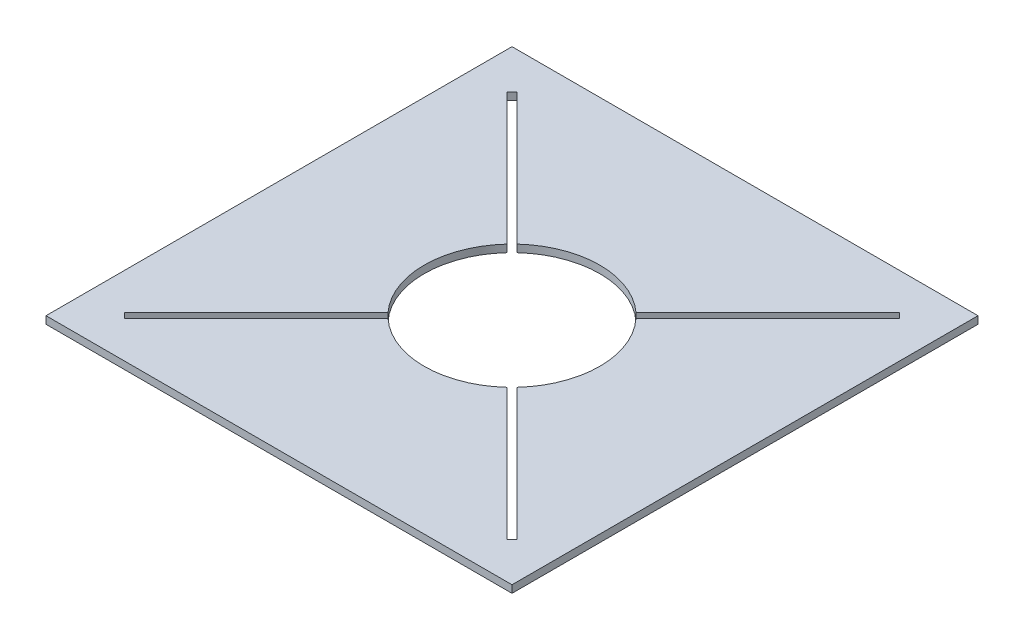
ISO-10303-21;
HEADER;
FILE_DESCRIPTION(('STEP AP214'),'2;1');
FILE_NAME('part.step','',(''),(''),'','','');
FILE_SCHEMA(('AUTOMOTIVE_DESIGN { 1 0 10303 214 1 1 1 1 }'));
ENDSEC;
DATA;
#1=APPLICATION_CONTEXT('core data for automotive mechanical design processes');
#2=APPLICATION_PROTOCOL_DEFINITION('international standard','automotive_design',2000,#1);
#3=PRODUCT_CONTEXT('',#1,'mechanical');
#4=PRODUCT('Part','Part','',(#3));
#5=PRODUCT_RELATED_PRODUCT_CATEGORY('part','',(#4));
#6=PRODUCT_DEFINITION_FORMATION('','',#4);
#7=PRODUCT_DEFINITION_CONTEXT('part definition',#1,'design');
#8=PRODUCT_DEFINITION('design','',#6,#7);
#9=PRODUCT_DEFINITION_SHAPE('','',#8);
#10=(LENGTH_UNIT() NAMED_UNIT(*) SI_UNIT(.MILLI.,.METRE.));
#11=(NAMED_UNIT(*) PLANE_ANGLE_UNIT() SI_UNIT($,.RADIAN.));
#12=(NAMED_UNIT(*) SI_UNIT($,.STERADIAN.) SOLID_ANGLE_UNIT());
#13=UNCERTAINTY_MEASURE_WITH_UNIT(LENGTH_MEASURE(1.E-05),#10,'distance_accuracy_value','');
#14=(GEOMETRIC_REPRESENTATION_CONTEXT(3) GLOBAL_UNCERTAINTY_ASSIGNED_CONTEXT((#13)) GLOBAL_UNIT_ASSIGNED_CONTEXT((#10,
#11,#12)) REPRESENTATION_CONTEXT('',''));
#15=CARTESIAN_POINT('',(0.,0.,0.));
#16=DIRECTION('',(0.,0.,1.));
#17=DIRECTION('',(1.,0.,0.));
#18=AXIS2_PLACEMENT_3D('',#15,#16,#17);
#19=CARTESIAN_POINT('',(0.,0.,0.));
#20=DIRECTION('',(0.,1.,0.));
#21=DIRECTION('',(0.,0.,1.));
#22=AXIS2_PLACEMENT_3D('',#19,#20,#21);
#23=CYLINDRICAL_SURFACE('',#22,77.79258);
#24=CARTESIAN_POINT('',(0.,0.,0.));
#25=DIRECTION('',(0.,1.,0.));
#26=DIRECTION('',(0.,0.,1.));
#27=AXIS2_PLACEMENT_3D('',#24,#25,#26);
#28=CIRCLE('',#27,77.79258);
#29=CARTESIAN_POINT('',(-57.2671491611774,0.,-52.6512975149506));
#30=VERTEX_POINT('',#29);
#31=CARTESIAN_POINT('',(-57.2585452817661,0.,52.6606541477823));
#32=VERTEX_POINT('',#31);
#33=EDGE_CURVE('E259',#30,#32,#28,.T.);
#34=ORIENTED_EDGE('',*,*,#33,.F.);
#35=DIRECTION('',(0.,1.,0.));
#36=VECTOR('',#35,1.);
#37=CARTESIAN_POINT('',(-57.2671491611775,0.,-52.6512975149506));
#38=LINE('',#37,#36);
#39=CARTESIAN_POINT('',(-57.2671491611774,6.60400000000002,-52.6512975149506));
#40=VERTEX_POINT('',#39);
#41=EDGE_CURVE('E217',#30,#40,#38,.T.);
#42=ORIENTED_EDGE('',*,*,#41,.T.);
#43=CARTESIAN_POINT('',(0.,6.60400000000002,0.));
#44=DIRECTION('',(0.,1.,0.));
#45=DIRECTION('',(0.,0.,1.));
#46=AXIS2_PLACEMENT_3D('',#43,#44,#45);
#47=CIRCLE('',#46,77.79258);
#48=CARTESIAN_POINT('',(-57.2585452817661,6.60400000000002,52.6606541477823));
#49=VERTEX_POINT('',#48);
#50=EDGE_CURVE('E265',#40,#49,#47,.T.);
#51=ORIENTED_EDGE('',*,*,#50,.T.);
#52=DIRECTION('',(0.,1.,0.));
#53=VECTOR('',#52,1.);
#54=CARTESIAN_POINT('',(-57.2585452817661,0.,52.6606541477823));
#55=LINE('',#54,#53);
#56=EDGE_CURVE('E306',#49,#32,#55,.F.);
#57=ORIENTED_EDGE('',*,*,#56,.T.);
#58=EDGE_LOOP('',(#34,#42,#51,#57));
#59=FACE_BOUND('',#58,.T.);
#60=ADVANCED_FACE('F33',(#59),#23,.F.);
#61=CARTESIAN_POINT('',(-52.6606541477821,6.60400000000002,57.2585452817663));
#62=VERTEX_POINT('',#61);
#63=CARTESIAN_POINT('',(52.6512975149513,6.60400000000002,57.2671491611769));
#64=VERTEX_POINT('',#63);
#65=EDGE_CURVE('E262',#62,#64,#47,.T.);
#66=ORIENTED_EDGE('',*,*,#65,.T.);
#67=DIRECTION('',(0.,1.,0.));
#68=VECTOR('',#67,1.);
#69=CARTESIAN_POINT('',(52.6512975149513,0.,57.2671491611769));
#70=LINE('',#69,#68);
#71=CARTESIAN_POINT('',(52.6512975149513,0.,57.2671491611769));
#72=VERTEX_POINT('',#71);
#73=EDGE_CURVE('E11',#64,#72,#70,.F.);
#74=ORIENTED_EDGE('',*,*,#73,.T.);
#75=CARTESIAN_POINT('',(-52.6606541477821,0.,57.2585452817663));
#76=VERTEX_POINT('',#75);
#77=EDGE_CURVE('E257',#76,#72,#28,.T.);
#78=ORIENTED_EDGE('',*,*,#77,.F.);
#79=DIRECTION('',(0.,1.,0.));
#80=VECTOR('',#79,1.);
#81=CARTESIAN_POINT('',(-52.6606541477821,0.,57.2585452817663));
#82=LINE('',#81,#80);
#83=EDGE_CURVE('E291',#76,#62,#82,.T.);
#84=ORIENTED_EDGE('',*,*,#83,.T.);
#85=EDGE_LOOP('',(#66,#74,#78,#84));
#86=FACE_BOUND('',#85,.T.);
#87=ADVANCED_FACE('F371',(#86),#23,.F.);
#88=CARTESIAN_POINT('',(52.6606541477821,6.60400000000002,-57.2585452817663));
#89=VERTEX_POINT('',#88);
#90=CARTESIAN_POINT('',(-52.6512975149512,6.60400000000002,-57.267149161177));
#91=VERTEX_POINT('',#90);
#92=EDGE_CURVE('E266',#89,#91,#47,.T.);
#93=ORIENTED_EDGE('',*,*,#92,.T.);
#94=DIRECTION('',(0.,1.,0.));
#95=VECTOR('',#94,1.);
#96=CARTESIAN_POINT('',(-52.6512975149512,0.,-57.267149161177));
#97=LINE('',#96,#95);
#98=CARTESIAN_POINT('',(-52.6512975149512,0.,-57.267149161177));
#99=VERTEX_POINT('',#98);
#100=EDGE_CURVE('E211',#91,#99,#97,.F.);
#101=ORIENTED_EDGE('',*,*,#100,.T.);
#102=CARTESIAN_POINT('',(52.6606541477821,0.,-57.2585452817663));
#103=VERTEX_POINT('',#102);
#104=EDGE_CURVE('E261',#103,#99,#28,.T.);
#105=ORIENTED_EDGE('',*,*,#104,.F.);
#106=DIRECTION('',(0.,1.,0.));
#107=VECTOR('',#106,1.);
#108=CARTESIAN_POINT('',(52.660654147782,0.,-57.2585452817663));
#109=LINE('',#108,#107);
#110=EDGE_CURVE('E303',#103,#89,#109,.T.);
#111=ORIENTED_EDGE('',*,*,#110,.T.);
#112=EDGE_LOOP('',(#93,#101,#105,#111));
#113=FACE_BOUND('',#112,.T.);
#114=ADVANCED_FACE('F348',(#113),#23,.F.);
#115=CARTESIAN_POINT('',(-206.545890784591,6.60400000000002,206.54589078459));
#116=DIRECTION('',(-1.,0.,0.));
#117=DIRECTION('',(0.,0.,1.));
#118=AXIS2_PLACEMENT_3D('',#115,#116,#117);
#119=PLANE('',#118);
#120=DIRECTION('',(0.,0.,-1.));
#121=VECTOR('',#120,1.);
#122=CARTESIAN_POINT('',(-206.545890784591,0.,206.54589078459));
#123=LINE('',#122,#121);
#124=CARTESIAN_POINT('',(-206.545890784591,0.,206.54589078459));
#125=VERTEX_POINT('',#124);
#126=CARTESIAN_POINT('',(-206.545890784591,0.,-206.54589078459));
#127=VERTEX_POINT('',#126);
#128=EDGE_CURVE('E279',#125,#127,#123,.T.);
#129=ORIENTED_EDGE('',*,*,#128,.F.);
#130=DIRECTION('',(0.,-1.,0.));
#131=VECTOR('',#130,1.);
#132=CARTESIAN_POINT('',(-206.545890784591,6.60400000000002,206.54589078459));
#133=LINE('',#132,#131);
#134=CARTESIAN_POINT('',(-206.545890784591,6.60400000000002,206.54589078459));
#135=VERTEX_POINT('',#134);
#136=EDGE_CURVE('E289',#135,#125,#133,.T.);
#137=ORIENTED_EDGE('',*,*,#136,.F.);
#138=DIRECTION('',(0.,0.,-1.));
#139=VECTOR('',#138,1.);
#140=CARTESIAN_POINT('',(-206.545890784591,6.60400000000002,206.54589078459));
#141=LINE('',#140,#139);
#142=CARTESIAN_POINT('',(-206.545890784591,6.60400000000002,-206.54589078459));
#143=VERTEX_POINT('',#142);
#144=EDGE_CURVE('E267',#135,#143,#141,.T.);
#145=ORIENTED_EDGE('',*,*,#144,.T.);
#146=DIRECTION('',(0.,-1.,0.));
#147=VECTOR('',#146,1.);
#148=CARTESIAN_POINT('',(-206.545890784591,6.60400000000002,-206.54589078459));
#149=LINE('',#148,#147);
#150=EDGE_CURVE('E278',#143,#127,#149,.T.);
#151=ORIENTED_EDGE('',*,*,#150,.T.);
#152=EDGE_LOOP('',(#129,#137,#145,#151));
#153=FACE_BOUND('',#152,.T.);
#154=ADVANCED_FACE('F35',(#153),#119,.T.);
#155=CARTESIAN_POINT('',(-206.545890784591,6.60400000000002,206.54589078459));
#156=DIRECTION('',(0.,0.,-1.));
#157=DIRECTION('',(-1.,0.,0.));
#158=AXIS2_PLACEMENT_3D('',#155,#156,#157);
#159=PLANE('',#158);
#160=DIRECTION('',(1.,0.,0.));
#161=VECTOR('',#160,1.);
#162=CARTESIAN_POINT('',(-206.545890784591,0.,206.54589078459));
#163=LINE('',#162,#161);
#164=CARTESIAN_POINT('',(206.54589078459,0.,206.54589078459));
#165=VERTEX_POINT('',#164);
#166=EDGE_CURVE('E271',#125,#165,#163,.T.);
#167=ORIENTED_EDGE('',*,*,#166,.T.);
#168=DIRECTION('',(0.,-1.,0.));
#169=VECTOR('',#168,1.);
#170=CARTESIAN_POINT('',(206.54589078459,6.60400000000002,206.54589078459));
#171=LINE('',#170,#169);
#172=CARTESIAN_POINT('',(206.54589078459,6.60400000000002,206.54589078459));
#173=VERTEX_POINT('',#172);
#174=EDGE_CURVE('E292',#173,#165,#171,.T.);
#175=ORIENTED_EDGE('',*,*,#174,.F.);
#176=DIRECTION('',(1.,0.,0.));
#177=VECTOR('',#176,1.);
#178=CARTESIAN_POINT('',(-206.545890784591,6.60400000000002,206.54589078459));
#179=LINE('',#178,#177);
#180=EDGE_CURVE('E276',#135,#173,#179,.T.);
#181=ORIENTED_EDGE('',*,*,#180,.F.);
#182=ORIENTED_EDGE('',*,*,#136,.T.);
#183=EDGE_LOOP('',(#167,#175,#181,#182));
#184=FACE_BOUND('',#183,.T.);
#185=ADVANCED_FACE('F392',(#184),#159,.F.);
#186=CARTESIAN_POINT('',(206.54589078459,6.60400000000002,206.54589078459));
#187=DIRECTION('',(-1.,0.,0.));
#188=DIRECTION('',(0.,0.,1.));
#189=AXIS2_PLACEMENT_3D('',#186,#187,#188);
#190=PLANE('',#189);
#191=DIRECTION('',(0.,0.,-1.));
#192=VECTOR('',#191,1.);
#193=CARTESIAN_POINT('',(206.54589078459,0.,206.54589078459));
#194=LINE('',#193,#192);
#195=CARTESIAN_POINT('',(206.54589078459,0.,-206.54589078459));
#196=VERTEX_POINT('',#195);
#197=EDGE_CURVE('E285',#165,#196,#194,.T.);
#198=ORIENTED_EDGE('',*,*,#197,.T.);
#199=DIRECTION('',(0.,-1.,0.));
#200=VECTOR('',#199,1.);
#201=CARTESIAN_POINT('',(206.54589078459,6.60400000000002,-206.54589078459));
#202=LINE('',#201,#200);
#203=CARTESIAN_POINT('',(206.54589078459,6.60400000000002,-206.54589078459));
#204=VERTEX_POINT('',#203);
#205=EDGE_CURVE('E295',#204,#196,#202,.T.);
#206=ORIENTED_EDGE('',*,*,#205,.F.);
#207=DIRECTION('',(0.,0.,-1.));
#208=VECTOR('',#207,1.);
#209=CARTESIAN_POINT('',(206.54589078459,6.60400000000002,206.54589078459));
#210=LINE('',#209,#208);
#211=EDGE_CURVE('E274',#173,#204,#210,.T.);
#212=ORIENTED_EDGE('',*,*,#211,.F.);
#213=ORIENTED_EDGE('',*,*,#174,.T.);
#214=EDGE_LOOP('',(#198,#206,#212,#213));
#215=FACE_BOUND('',#214,.T.);
#216=ADVANCED_FACE('F397',(#215),#190,.F.);
#217=CARTESIAN_POINT('',(-206.545890784591,6.60400000000002,-206.54589078459));
#218=DIRECTION('',(0.,0.,-1.));
#219=DIRECTION('',(-1.,0.,0.));
#220=AXIS2_PLACEMENT_3D('',#217,#218,#219);
#221=PLANE('',#220);
#222=DIRECTION('',(1.,0.,0.));
#223=VECTOR('',#222,1.);
#224=CARTESIAN_POINT('',(-206.545890784591,0.,-206.54589078459));
#225=LINE('',#224,#223);
#226=EDGE_CURVE('E282',#127,#196,#225,.T.);
#227=ORIENTED_EDGE('',*,*,#226,.F.);
#228=ORIENTED_EDGE('',*,*,#150,.F.);
#229=DIRECTION('',(1.,0.,0.));
#230=VECTOR('',#229,1.);
#231=CARTESIAN_POINT('',(-206.545890784591,6.60400000000002,-206.54589078459));
#232=LINE('',#231,#230);
#233=EDGE_CURVE('E270',#143,#204,#232,.T.);
#234=ORIENTED_EDGE('',*,*,#233,.T.);
#235=ORIENTED_EDGE('',*,*,#205,.T.);
#236=EDGE_LOOP('',(#227,#228,#234,#235));
#237=FACE_BOUND('',#236,.T.);
#238=ADVANCED_FACE('F412',(#237),#221,.T.);
#239=CARTESIAN_POINT('',(0.,6.60400000000002,0.));
#240=DIRECTION('',(0.,-1.,0.));
#241=DIRECTION('',(0.,0.,-1.));
#242=AXIS2_PLACEMENT_3D('',#239,#240,#241);
#243=PLANE('',#242);
#244=ORIENTED_EDGE('',*,*,#50,.F.);
#245=DIRECTION('',(0.707106781186551,0.,0.707106781186544));
#246=VECTOR('',#245,1.);
#247=CARTESIAN_POINT('',(169.448452748456,6.60400000000002,174.06430439468));
#248=LINE('',#247,#246);
#249=CARTESIAN_POINT('',(-174.064304394683,6.60400000000002,-169.448452748455));
#250=VERTEX_POINT('',#249);
#251=EDGE_CURVE('E195',#250,#40,#248,.T.);
#252=ORIENTED_EDGE('',*,*,#251,.F.);
#253=DIRECTION('',(-0.707106781186539,0.,0.707106781186556));
#254=VECTOR('',#253,1.);
#255=CARTESIAN_POINT('',(-169.448452748457,6.60400000000002,-174.064304394681));
#256=LINE('',#255,#254);
#257=CARTESIAN_POINT('',(-169.448452748457,6.60400000000002,-174.064304394681));
#258=VERTEX_POINT('',#257);
#259=EDGE_CURVE('E206',#258,#250,#256,.T.);
#260=ORIENTED_EDGE('',*,*,#259,.F.);
#261=DIRECTION('',(-0.707106781186551,0.,-0.707106781186544));
#262=VECTOR('',#261,1.);
#263=CARTESIAN_POINT('',(174.064304394682,6.60400000000002,169.448452748454));
#264=LINE('',#263,#262);
#265=EDGE_CURVE('E204',#91,#258,#264,.T.);
#266=ORIENTED_EDGE('',*,*,#265,.F.);
#267=ORIENTED_EDGE('',*,*,#92,.F.);
#268=DIRECTION('',(-0.707106781186546,0.,0.707106781186549));
#269=VECTOR('',#268,1.);
#270=CARTESIAN_POINT('',(-174.05532413856,6.60400000000002,169.457433004576));
#271=LINE('',#270,#269);
#272=CARTESIAN_POINT('',(169.457433004577,6.60400000000002,-174.055324138562));
#273=VERTEX_POINT('',#272);
#274=EDGE_CURVE('E225',#273,#89,#271,.T.);
#275=ORIENTED_EDGE('',*,*,#274,.F.);
#276=DIRECTION('',(-0.707106781186547,0.,-0.707106781186547));
#277=VECTOR('',#276,1.);
#278=CARTESIAN_POINT('',(169.457433004577,6.60400000000002,-174.055324138562));
#279=LINE('',#278,#277);
#280=CARTESIAN_POINT('',(174.055324138561,6.60400000000002,-169.457433004578));
#281=VERTEX_POINT('',#280);
#282=EDGE_CURVE('E242',#281,#273,#279,.T.);
#283=ORIENTED_EDGE('',*,*,#282,.F.);
#284=DIRECTION('',(0.707106781186546,0.,-0.707106781186549));
#285=VECTOR('',#284,1.);
#286=CARTESIAN_POINT('',(-169.457433004576,6.60400000000002,174.05532413856));
#287=LINE('',#286,#285);
#288=CARTESIAN_POINT('',(57.2585452817661,6.60400000000002,-52.6606541477823));
#289=VERTEX_POINT('',#288);
#290=EDGE_CURVE('E239',#289,#281,#287,.T.);
#291=ORIENTED_EDGE('',*,*,#290,.F.);
#292=CARTESIAN_POINT('',(57.2671491611775,6.60400000000002,52.6512975149506));
#293=VERTEX_POINT('',#292);
#294=EDGE_CURVE('E250',#293,#289,#47,.T.);
#295=ORIENTED_EDGE('',*,*,#294,.F.);
#296=CARTESIAN_POINT('',(174.064304394682,6.60400000000002,169.448452748454));
#297=VERTEX_POINT('',#296);
#298=EDGE_CURVE('E56',#297,#293,#264,.T.);
#299=ORIENTED_EDGE('',*,*,#298,.F.);
#300=DIRECTION('',(0.707106781186539,0.,-0.707106781186556));
#301=VECTOR('',#300,1.);
#302=CARTESIAN_POINT('',(174.064304394682,6.60400000000002,169.448452748454));
#303=LINE('',#302,#301);
#304=CARTESIAN_POINT('',(169.448452748456,6.60400000000002,174.06430439468));
#305=VERTEX_POINT('',#304);
#306=EDGE_CURVE('E179',#305,#297,#303,.T.);
#307=ORIENTED_EDGE('',*,*,#306,.F.);
#308=EDGE_CURVE('E198',#64,#305,#248,.T.);
#309=ORIENTED_EDGE('',*,*,#308,.F.);
#310=ORIENTED_EDGE('',*,*,#65,.F.);
#311=CARTESIAN_POINT('',(-169.457433004576,6.60400000000002,174.05532413856));
#312=VERTEX_POINT('',#311);
#313=EDGE_CURVE('E240',#312,#62,#287,.T.);
#314=ORIENTED_EDGE('',*,*,#313,.F.);
#315=DIRECTION('',(0.707106781186548,0.,0.707106781186548));
#316=VECTOR('',#315,1.);
#317=CARTESIAN_POINT('',(-174.05532413856,6.60400000000002,169.457433004576));
#318=LINE('',#317,#316);
#319=CARTESIAN_POINT('',(-174.05532413856,6.60400000000002,169.457433004576));
#320=VERTEX_POINT('',#319);
#321=EDGE_CURVE('E220',#320,#312,#318,.T.);
#322=ORIENTED_EDGE('',*,*,#321,.F.);
#323=EDGE_CURVE('E245',#49,#320,#271,.T.);
#324=ORIENTED_EDGE('',*,*,#323,.F.);
#325=EDGE_LOOP('',(#244,#252,#260,#266,#267,#275,#283,#291,#295,#299,#307,#309,#310,#314,#322,#324));
#326=FACE_BOUND('',#325,.T.);
#327=ORIENTED_EDGE('',*,*,#144,.F.);
#328=ORIENTED_EDGE('',*,*,#180,.T.);
#329=ORIENTED_EDGE('',*,*,#211,.T.);
#330=ORIENTED_EDGE('',*,*,#233,.F.);
#331=EDGE_LOOP('',(#327,#328,#329,#330));
#332=FACE_BOUND('',#331,.T.);
#333=ADVANCED_FACE('F315',(#326,#332),#243,.F.);
#334=CARTESIAN_POINT('',(0.,0.,0.));
#335=DIRECTION('',(0.,-1.,0.));
#336=DIRECTION('',(0.,0.,-1.));
#337=AXIS2_PLACEMENT_3D('',#334,#335,#336);
#338=PLANE('',#337);
#339=DIRECTION('',(0.707106781186551,0.,0.707106781186544));
#340=VECTOR('',#339,1.);
#341=CARTESIAN_POINT('',(169.448452748456,0.,174.06430439468));
#342=LINE('',#341,#340);
#343=CARTESIAN_POINT('',(-174.064304394683,0.,-169.448452748455));
#344=VERTEX_POINT('',#343);
#345=EDGE_CURVE('E181',#344,#30,#342,.T.);
#346=ORIENTED_EDGE('',*,*,#345,.T.);
#347=ORIENTED_EDGE('',*,*,#33,.T.);
#348=DIRECTION('',(-0.707106781186546,0.,0.707106781186549));
#349=VECTOR('',#348,1.);
#350=CARTESIAN_POINT('',(-174.05532413856,0.,169.457433004576));
#351=LINE('',#350,#349);
#352=CARTESIAN_POINT('',(-174.05532413856,0.,169.457433004576));
#353=VERTEX_POINT('',#352);
#354=EDGE_CURVE('E232',#32,#353,#351,.T.);
#355=ORIENTED_EDGE('',*,*,#354,.T.);
#356=DIRECTION('',(0.707106781186548,0.,0.707106781186548));
#357=VECTOR('',#356,1.);
#358=CARTESIAN_POINT('',(-174.05532413856,0.,169.457433004576));
#359=LINE('',#358,#357);
#360=CARTESIAN_POINT('',(-169.457433004576,0.,174.05532413856));
#361=VERTEX_POINT('',#360);
#362=EDGE_CURVE('E221',#353,#361,#359,.T.);
#363=ORIENTED_EDGE('',*,*,#362,.T.);
#364=DIRECTION('',(0.707106781186546,0.,-0.707106781186549));
#365=VECTOR('',#364,1.);
#366=CARTESIAN_POINT('',(-169.457433004576,0.,174.05532413856));
#367=LINE('',#366,#365);
#368=EDGE_CURVE('E226',#361,#76,#367,.T.);
#369=ORIENTED_EDGE('',*,*,#368,.T.);
#370=ORIENTED_EDGE('',*,*,#77,.T.);
#371=CARTESIAN_POINT('',(169.448452748456,0.,174.06430439468));
#372=VERTEX_POINT('',#371);
#373=EDGE_CURVE('E194',#72,#372,#342,.T.);
#374=ORIENTED_EDGE('',*,*,#373,.T.);
#375=DIRECTION('',(0.707106781186539,0.,-0.707106781186556));
#376=VECTOR('',#375,1.);
#377=CARTESIAN_POINT('',(174.064304394682,0.,169.448452748454));
#378=LINE('',#377,#376);
#379=CARTESIAN_POINT('',(174.064304394682,0.,169.448452748454));
#380=VERTEX_POINT('',#379);
#381=EDGE_CURVE('E176',#372,#380,#378,.T.);
#382=ORIENTED_EDGE('',*,*,#381,.T.);
#383=DIRECTION('',(-0.707106781186551,0.,-0.707106781186544));
#384=VECTOR('',#383,1.);
#385=CARTESIAN_POINT('',(174.064304394682,0.,169.448452748454));
#386=LINE('',#385,#384);
#387=CARTESIAN_POINT('',(57.2671491611775,0.,52.6512975149506));
#388=VERTEX_POINT('',#387);
#389=EDGE_CURVE('E184',#380,#388,#386,.T.);
#390=ORIENTED_EDGE('',*,*,#389,.T.);
#391=CARTESIAN_POINT('',(57.2585452817661,0.,-52.6606541477823));
#392=VERTEX_POINT('',#391);
#393=EDGE_CURVE('E260',#388,#392,#28,.T.);
#394=ORIENTED_EDGE('',*,*,#393,.T.);
#395=CARTESIAN_POINT('',(174.055324138561,0.,-169.457433004578));
#396=VERTEX_POINT('',#395);
#397=EDGE_CURVE('E224',#392,#396,#367,.T.);
#398=ORIENTED_EDGE('',*,*,#397,.T.);
#399=DIRECTION('',(-0.707106781186547,0.,-0.707106781186547));
#400=VECTOR('',#399,1.);
#401=CARTESIAN_POINT('',(169.457433004577,0.,-174.055324138562));
#402=LINE('',#401,#400);
#403=CARTESIAN_POINT('',(169.457433004577,0.,-174.055324138562));
#404=VERTEX_POINT('',#403);
#405=EDGE_CURVE('E229',#396,#404,#402,.T.);
#406=ORIENTED_EDGE('',*,*,#405,.T.);
#407=EDGE_CURVE('E233',#404,#103,#351,.T.);
#408=ORIENTED_EDGE('',*,*,#407,.T.);
#409=ORIENTED_EDGE('',*,*,#104,.T.);
#410=CARTESIAN_POINT('',(-169.448452748457,0.,-174.064304394681));
#411=VERTEX_POINT('',#410);
#412=EDGE_CURVE('E188',#99,#411,#386,.T.);
#413=ORIENTED_EDGE('',*,*,#412,.T.);
#414=DIRECTION('',(-0.707106781186539,0.,0.707106781186556));
#415=VECTOR('',#414,1.);
#416=CARTESIAN_POINT('',(-169.448452748457,0.,-174.064304394681));
#417=LINE('',#416,#415);
#418=EDGE_CURVE('E48',#411,#344,#417,.T.);
#419=ORIENTED_EDGE('',*,*,#418,.T.);
#420=EDGE_LOOP('',(#346,#347,#355,#363,#369,#370,#374,#382,#390,#394,#398,#406,#408,#409,#413,#419));
#421=FACE_BOUND('',#420,.T.);
#422=ORIENTED_EDGE('',*,*,#128,.T.);
#423=ORIENTED_EDGE('',*,*,#226,.T.);
#424=ORIENTED_EDGE('',*,*,#197,.F.);
#425=ORIENTED_EDGE('',*,*,#166,.F.);
#426=EDGE_LOOP('',(#422,#423,#424,#425));
#427=FACE_BOUND('',#426,.T.);
#428=ADVANCED_FACE('F191',(#421,#427),#338,.T.);
#429=ORIENTED_EDGE('',*,*,#393,.F.);
#430=DIRECTION('',(0.,1.,0.));
#431=VECTOR('',#430,1.);
#432=CARTESIAN_POINT('',(57.2671491611775,0.,52.6512975149506));
#433=LINE('',#432,#431);
#434=EDGE_CURVE('E41',#388,#293,#433,.T.);
#435=ORIENTED_EDGE('',*,*,#434,.T.);
#436=ORIENTED_EDGE('',*,*,#294,.T.);
#437=DIRECTION('',(0.,1.,0.));
#438=VECTOR('',#437,1.);
#439=CARTESIAN_POINT('',(57.2585452817661,0.,-52.6606541477823));
#440=LINE('',#439,#438);
#441=EDGE_CURVE('E300',#289,#392,#440,.F.);
#442=ORIENTED_EDGE('',*,*,#441,.T.);
#443=EDGE_LOOP('',(#429,#435,#436,#442));
#444=FACE_BOUND('',#443,.T.);
#445=ADVANCED_FACE('F310',(#444),#23,.F.);
#446=CARTESIAN_POINT('',(-169.457433004576,0.,174.05532413856));
#447=DIRECTION('',(0.707106781186549,0.,0.707106781186546));
#448=DIRECTION('',(0.707106781186546,0.,-0.707106781186549));
#449=AXIS2_PLACEMENT_3D('',#446,#447,#448);
#450=PLANE('',#449);
#451=ORIENTED_EDGE('',*,*,#368,.F.);
#452=DIRECTION('',(0.,1.,0.));
#453=VECTOR('',#452,1.);
#454=CARTESIAN_POINT('',(-169.457433004576,0.,174.05532413856));
#455=LINE('',#454,#453);
#456=EDGE_CURVE('E236',#361,#312,#455,.T.);
#457=ORIENTED_EDGE('',*,*,#456,.T.);
#458=ORIENTED_EDGE('',*,*,#313,.T.);
#459=ORIENTED_EDGE('',*,*,#83,.F.);
#460=EDGE_LOOP('',(#451,#457,#458,#459));
#461=FACE_BOUND('',#460,.T.);
#462=ADVANCED_FACE('F380',(#461),#450,.F.);
#463=CARTESIAN_POINT('',(-174.05532413856,0.,169.457433004576));
#464=DIRECTION('',(-0.707106781186549,0.,-0.707106781186546));
#465=DIRECTION('',(-0.707106781186546,0.,0.707106781186549));
#466=AXIS2_PLACEMENT_3D('',#463,#464,#465);
#467=PLANE('',#466);
#468=ORIENTED_EDGE('',*,*,#323,.T.);
#469=DIRECTION('',(0.,1.,0.));
#470=VECTOR('',#469,1.);
#471=CARTESIAN_POINT('',(-174.05532413856,0.,169.457433004576));
#472=LINE('',#471,#470);
#473=EDGE_CURVE('E247',#353,#320,#472,.T.);
#474=ORIENTED_EDGE('',*,*,#473,.F.);
#475=ORIENTED_EDGE('',*,*,#354,.F.);
#476=ORIENTED_EDGE('',*,*,#56,.F.);
#477=EDGE_LOOP('',(#468,#474,#475,#476));
#478=FACE_BOUND('',#477,.T.);
#479=ADVANCED_FACE('F326',(#478),#467,.F.);
#480=CARTESIAN_POINT('',(-174.05532413856,0.,169.457433004576));
#481=DIRECTION('',(-0.707106781186547,0.,0.707106781186547));
#482=DIRECTION('',(0.707106781186548,0.,0.707106781186548));
#483=AXIS2_PLACEMENT_3D('',#480,#481,#482);
#484=PLANE('',#483);
#485=ORIENTED_EDGE('',*,*,#321,.T.);
#486=ORIENTED_EDGE('',*,*,#456,.F.);
#487=ORIENTED_EDGE('',*,*,#362,.F.);
#488=ORIENTED_EDGE('',*,*,#473,.T.);
#489=EDGE_LOOP('',(#485,#486,#487,#488));
#490=FACE_BOUND('',#489,.T.);
#491=ADVANCED_FACE('F332',(#490),#484,.F.);
#492=ORIENTED_EDGE('',*,*,#407,.F.);
#493=DIRECTION('',(0.,1.,0.));
#494=VECTOR('',#493,1.);
#495=CARTESIAN_POINT('',(169.457433004577,0.,-174.055324138562));
#496=LINE('',#495,#494);
#497=EDGE_CURVE('E251',#404,#273,#496,.T.);
#498=ORIENTED_EDGE('',*,*,#497,.T.);
#499=ORIENTED_EDGE('',*,*,#274,.T.);
#500=ORIENTED_EDGE('',*,*,#110,.F.);
#501=EDGE_LOOP('',(#492,#498,#499,#500));
#502=FACE_BOUND('',#501,.T.);
#503=ADVANCED_FACE('F471',(#502),#467,.F.);
#504=ORIENTED_EDGE('',*,*,#290,.T.);
#505=DIRECTION('',(0.,1.,0.));
#506=VECTOR('',#505,1.);
#507=CARTESIAN_POINT('',(174.055324138561,0.,-169.457433004578));
#508=LINE('',#507,#506);
#509=EDGE_CURVE('E253',#396,#281,#508,.T.);
#510=ORIENTED_EDGE('',*,*,#509,.F.);
#511=ORIENTED_EDGE('',*,*,#397,.F.);
#512=ORIENTED_EDGE('',*,*,#441,.F.);
#513=EDGE_LOOP('',(#504,#510,#511,#512));
#514=FACE_BOUND('',#513,.T.);
#515=ADVANCED_FACE('F340',(#514),#450,.F.);
#516=CARTESIAN_POINT('',(169.457433004577,0.,-174.055324138562));
#517=DIRECTION('',(0.707106781186547,0.,-0.707106781186547));
#518=DIRECTION('',(-0.707106781186548,0.,-0.707106781186548));
#519=AXIS2_PLACEMENT_3D('',#516,#517,#518);
#520=PLANE('',#519);
#521=ORIENTED_EDGE('',*,*,#282,.T.);
#522=ORIENTED_EDGE('',*,*,#497,.F.);
#523=ORIENTED_EDGE('',*,*,#405,.F.);
#524=ORIENTED_EDGE('',*,*,#509,.T.);
#525=EDGE_LOOP('',(#521,#522,#523,#524));
#526=FACE_BOUND('',#525,.T.);
#527=ADVANCED_FACE('F343',(#526),#520,.F.);
#528=CARTESIAN_POINT('',(174.064304394682,0.,169.448452748454));
#529=DIRECTION('',(0.707106781186544,0.,-0.707106781186551));
#530=DIRECTION('',(-0.707106781186551,0.,-0.707106781186544));
#531=AXIS2_PLACEMENT_3D('',#528,#529,#530);
#532=PLANE('',#531);
#533=ORIENTED_EDGE('',*,*,#389,.F.);
#534=DIRECTION('',(0.,1.,0.));
#535=VECTOR('',#534,1.);
#536=CARTESIAN_POINT('',(174.064304394682,0.,169.448452748454));
#537=LINE('',#536,#535);
#538=EDGE_CURVE('E171',#380,#297,#537,.T.);
#539=ORIENTED_EDGE('',*,*,#538,.T.);
#540=ORIENTED_EDGE('',*,*,#298,.T.);
#541=ORIENTED_EDGE('',*,*,#434,.F.);
#542=EDGE_LOOP('',(#533,#539,#540,#541));
#543=FACE_BOUND('',#542,.T.);
#544=ADVANCED_FACE('F185',(#543),#532,.F.);
#545=CARTESIAN_POINT('',(169.448452748456,0.,174.06430439468));
#546=DIRECTION('',(-0.707106781186544,0.,0.707106781186551));
#547=DIRECTION('',(0.707106781186551,0.,0.707106781186544));
#548=AXIS2_PLACEMENT_3D('',#545,#546,#547);
#549=PLANE('',#548);
#550=ORIENTED_EDGE('',*,*,#308,.T.);
#551=DIRECTION('',(0.,1.,0.));
#552=VECTOR('',#551,1.);
#553=CARTESIAN_POINT('',(169.448452748456,0.,174.06430439468));
#554=LINE('',#553,#552);
#555=EDGE_CURVE('E209',#372,#305,#554,.T.);
#556=ORIENTED_EDGE('',*,*,#555,.F.);
#557=ORIENTED_EDGE('',*,*,#373,.F.);
#558=ORIENTED_EDGE('',*,*,#73,.F.);
#559=EDGE_LOOP('',(#550,#556,#557,#558));
#560=FACE_BOUND('',#559,.T.);
#561=ADVANCED_FACE('F360',(#560),#549,.F.);
#562=CARTESIAN_POINT('',(174.064304394682,0.,169.448452748454));
#563=DIRECTION('',(0.707106781186556,0.,0.707106781186539));
#564=DIRECTION('',(0.707106781186539,0.,-0.707106781186556));
#565=AXIS2_PLACEMENT_3D('',#562,#563,#564);
#566=PLANE('',#565);
#567=ORIENTED_EDGE('',*,*,#306,.T.);
#568=ORIENTED_EDGE('',*,*,#538,.F.);
#569=ORIENTED_EDGE('',*,*,#381,.F.);
#570=ORIENTED_EDGE('',*,*,#555,.T.);
#571=EDGE_LOOP('',(#567,#568,#569,#570));
#572=FACE_BOUND('',#571,.T.);
#573=ADVANCED_FACE('F173',(#572),#566,.F.);
#574=ORIENTED_EDGE('',*,*,#345,.F.);
#575=DIRECTION('',(0.,1.,0.));
#576=VECTOR('',#575,1.);
#577=CARTESIAN_POINT('',(-174.064304394683,0.,-169.448452748455));
#578=LINE('',#577,#576);
#579=EDGE_CURVE('E212',#344,#250,#578,.T.);
#580=ORIENTED_EDGE('',*,*,#579,.T.);
#581=ORIENTED_EDGE('',*,*,#251,.T.);
#582=ORIENTED_EDGE('',*,*,#41,.F.);
#583=EDGE_LOOP('',(#574,#580,#581,#582));
#584=FACE_BOUND('',#583,.T.);
#585=ADVANCED_FACE('F357',(#584),#549,.F.);
#586=ORIENTED_EDGE('',*,*,#265,.T.);
#587=DIRECTION('',(0.,1.,0.));
#588=VECTOR('',#587,1.);
#589=CARTESIAN_POINT('',(-169.448452748457,0.,-174.064304394681));
#590=LINE('',#589,#588);
#591=EDGE_CURVE('E180',#411,#258,#590,.T.);
#592=ORIENTED_EDGE('',*,*,#591,.F.);
#593=ORIENTED_EDGE('',*,*,#412,.F.);
#594=ORIENTED_EDGE('',*,*,#100,.F.);
#595=EDGE_LOOP('',(#586,#592,#593,#594));
#596=FACE_BOUND('',#595,.T.);
#597=ADVANCED_FACE('F352',(#596),#532,.F.);
#598=CARTESIAN_POINT('',(-169.448452748457,0.,-174.064304394681));
#599=DIRECTION('',(-0.707106781186556,0.,-0.707106781186539));
#600=DIRECTION('',(-0.707106781186539,0.,0.707106781186556));
#601=AXIS2_PLACEMENT_3D('',#598,#599,#600);
#602=PLANE('',#601);
#603=ORIENTED_EDGE('',*,*,#259,.T.);
#604=ORIENTED_EDGE('',*,*,#579,.F.);
#605=ORIENTED_EDGE('',*,*,#418,.F.);
#606=ORIENTED_EDGE('',*,*,#591,.T.);
#607=EDGE_LOOP('',(#603,#604,#605,#606));
#608=FACE_BOUND('',#607,.T.);
#609=ADVANCED_FACE('F355',(#608),#602,.F.);
#610=CLOSED_SHELL('',(#60,#87,#114,#154,#185,#216,#238,#333,#428,#445,#462,#479,#491,#503,#515,
#527,#544,#561,#573,#585,#597,#609));
#611=MANIFOLD_SOLID_BREP('B2',#610);
#612=ADVANCED_BREP_SHAPE_REPRESENTATION('',(#18,#611),#14);
#613=SHAPE_DEFINITION_REPRESENTATION(#9,#612);
ENDSEC;
END-ISO-10303-21;
